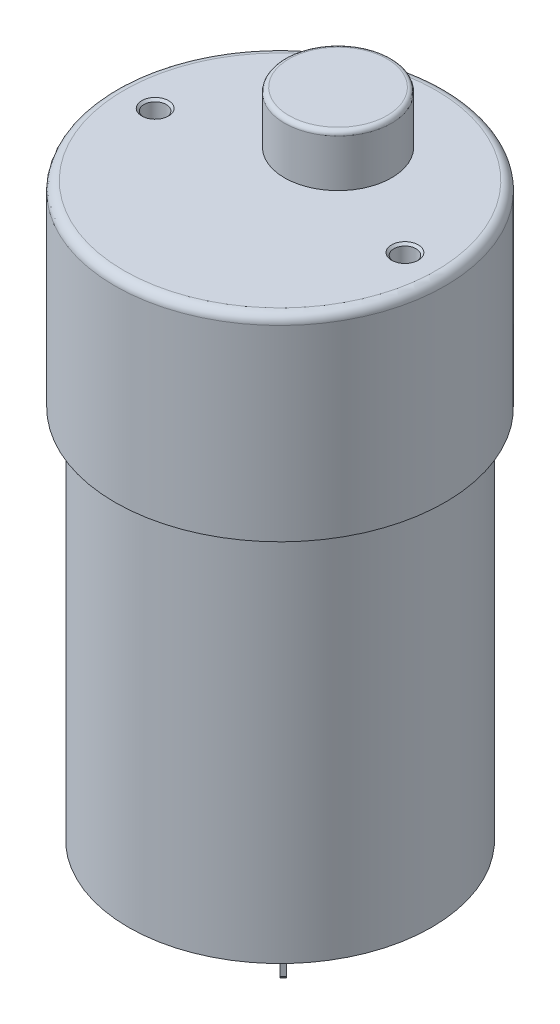
ISO-10303-21;
HEADER;
FILE_DESCRIPTION(('STEP AP214'),'2;1');
FILE_NAME('part.step','',(''),(''),'','','');
FILE_SCHEMA(('AUTOMOTIVE_DESIGN { 1 0 10303 214 1 1 1 1 }'));
ENDSEC;
DATA;
#1=APPLICATION_CONTEXT('core data for automotive mechanical design processes');
#2=APPLICATION_PROTOCOL_DEFINITION('international standard','automotive_design',2000,#1);
#3=PRODUCT_CONTEXT('',#1,'mechanical');
#4=PRODUCT('Part','Part','',(#3));
#5=PRODUCT_RELATED_PRODUCT_CATEGORY('part','',(#4));
#6=PRODUCT_DEFINITION_FORMATION('','',#4);
#7=PRODUCT_DEFINITION_CONTEXT('part definition',#1,'design');
#8=PRODUCT_DEFINITION('design','',#6,#7);
#9=PRODUCT_DEFINITION_SHAPE('','',#8);
#10=(LENGTH_UNIT() NAMED_UNIT(*) SI_UNIT(.MILLI.,.METRE.));
#11=(NAMED_UNIT(*) PLANE_ANGLE_UNIT() SI_UNIT($,.RADIAN.));
#12=(NAMED_UNIT(*) SI_UNIT($,.STERADIAN.) SOLID_ANGLE_UNIT());
#13=UNCERTAINTY_MEASURE_WITH_UNIT(LENGTH_MEASURE(1.E-05),#10,'distance_accuracy_value','');
#14=(GEOMETRIC_REPRESENTATION_CONTEXT(3) GLOBAL_UNCERTAINTY_ASSIGNED_CONTEXT((#13)) GLOBAL_UNIT_ASSIGNED_CONTEXT((#10,
#11,#12)) REPRESENTATION_CONTEXT('',''));
#15=CARTESIAN_POINT('',(0.,0.,0.));
#16=DIRECTION('',(0.,0.,1.));
#17=DIRECTION('',(1.,0.,0.));
#18=AXIS2_PLACEMENT_3D('',#15,#16,#17);
#19=CARTESIAN_POINT('',(0.,-44.5,0.));
#20=DIRECTION('',(0.,-1.,0.));
#21=DIRECTION('',(0.,0.,-1.));
#22=AXIS2_PLACEMENT_3D('',#19,#20,#21);
#23=PLANE('',#22);
#24=CARTESIAN_POINT('',(0.,-44.4999999999709,0.));
#25=DIRECTION('',(0.,1.,0.));
#26=DIRECTION('',(0.,0.,1.));
#27=AXIS2_PLACEMENT_3D('',#24,#25,#26);
#28=CIRCLE('',#27,1.99999999995271);
#29=CARTESIAN_POINT('',(0.,-44.4999999999709,1.99999999995271));
#30=VERTEX_POINT('',#29);
#31=EDGE_CURVE('E39',#30,#30,#28,.T.);
#32=ORIENTED_EDGE('',*,*,#31,.F.);
#33=EDGE_LOOP('',(#32));
#34=FACE_BOUND('',#33,.T.);
#35=ADVANCED_FACE('F36',(#34),#23,.T.);
#36=CARTESIAN_POINT('',(0.,27.8,0.));
#37=DIRECTION('',(0.,1.,0.));
#38=DIRECTION('',(0.,0.,1.));
#39=AXIS2_PLACEMENT_3D('',#36,#37,#38);
#40=PLANE('',#39);
#41=CARTESIAN_POINT('',(0.,27.8,-6.5));
#42=DIRECTION('',(0.,-1.,0.));
#43=DIRECTION('',(1.,0.,0.));
#44=AXIS2_PLACEMENT_3D('',#41,#42,#43);
#45=CIRCLE('',#44,5.5);
#46=CARTESIAN_POINT('',(5.5,27.8,-6.5));
#47=VERTEX_POINT('',#46);
#48=EDGE_CURVE('E240',#47,#47,#45,.T.);
#49=ORIENTED_EDGE('',*,*,#48,.F.);
#50=EDGE_LOOP('',(#49));
#51=FACE_BOUND('',#50,.T.);
#52=ADVANCED_FACE('F440',(#51),#40,.T.);
#53=CARTESIAN_POINT('',(0.,-43.4999999999945,0.));
#54=DIRECTION('',(0.,1.,0.));
#55=DIRECTION('',(0.,0.,1.));
#56=AXIS2_PLACEMENT_3D('',#53,#54,#55);
#57=CONICAL_SURFACE('',#56,2.9999999999859,0.78539816342587);
#58=CARTESIAN_POINT('',(0.,-43.5,0.));
#59=DIRECTION('',(0.,-1.,0.));
#60=DIRECTION('',(0.,0.,-1.));
#61=AXIS2_PLACEMENT_3D('',#58,#59,#60);
#62=CIRCLE('',#61,3.);
#63=CARTESIAN_POINT('',(0.,-43.5,-3.));
#64=VERTEX_POINT('',#63);
#65=EDGE_CURVE('E235',#64,#64,#62,.F.);
#66=ORIENTED_EDGE('',*,*,#65,.F.);
#67=EDGE_LOOP('',(#66));
#68=FACE_BOUND('',#67,.T.);
#69=ORIENTED_EDGE('',*,*,#31,.T.);
#70=EDGE_LOOP('',(#69));
#71=FACE_BOUND('',#70,.T.);
#72=ADVANCED_FACE('F254',(#68,#71),#57,.T.);
#73=CARTESIAN_POINT('',(0.,27.3,-6.5));
#74=DIRECTION('',(0.,1.,0.));
#75=DIRECTION('',(0.,0.,1.));
#76=AXIS2_PLACEMENT_3D('',#73,#74,#75);
#77=TOROIDAL_SURFACE('',#76,5.5,0.5);
#78=CARTESIAN_POINT('',(0.,27.3,-6.5));
#79=DIRECTION('',(0.,1.,0.));
#80=DIRECTION('',(0.,0.,1.));
#81=AXIS2_PLACEMENT_3D('',#78,#79,#80);
#82=CIRCLE('',#81,6.);
#83=CARTESIAN_POINT('',(0.,27.3,-0.5));
#84=VERTEX_POINT('',#83);
#85=EDGE_CURVE('E232',#84,#84,#82,.F.);
#86=ORIENTED_EDGE('',*,*,#85,.F.);
#87=EDGE_LOOP('',(#86));
#88=FACE_BOUND('',#87,.T.);
#89=ORIENTED_EDGE('',*,*,#48,.T.);
#90=EDGE_LOOP('',(#89));
#91=FACE_BOUND('',#90,.T.);
#92=ADVANCED_FACE('F248',(#88,#91),#77,.T.);
#93=CARTESIAN_POINT('',(0.,-41.,0.));
#94=DIRECTION('',(0.,-1.,0.));
#95=DIRECTION('',(0.,0.,-1.));
#96=AXIS2_PLACEMENT_3D('',#93,#94,#95);
#97=CYLINDRICAL_SURFACE('',#96,3.);
#98=CARTESIAN_POINT('',(0.,-42.,0.));
#99=DIRECTION('',(0.,-1.,0.));
#100=DIRECTION('',(0.,0.,-1.));
#101=AXIS2_PLACEMENT_3D('',#98,#99,#100);
#102=CIRCLE('',#101,3.);
#103=CARTESIAN_POINT('',(0.,-42.,-3.));
#104=VERTEX_POINT('',#103);
#105=EDGE_CURVE('E207',#104,#104,#102,.T.);
#106=ORIENTED_EDGE('',*,*,#105,.T.);
#107=EDGE_LOOP('',(#106));
#108=FACE_BOUND('',#107,.T.);
#109=ORIENTED_EDGE('',*,*,#65,.T.);
#110=EDGE_LOOP('',(#109));
#111=FACE_BOUND('',#110,.T.);
#112=ADVANCED_FACE('F253',(#108,#111),#97,.T.);
#113=CARTESIAN_POINT('',(0.,22.,-6.5));
#114=DIRECTION('',(0.,1.,0.));
#115=DIRECTION('',(0.,0.,1.));
#116=AXIS2_PLACEMENT_3D('',#113,#114,#115);
#117=CYLINDRICAL_SURFACE('',#116,6.);
#118=CARTESIAN_POINT('',(0.,22.,-6.5));
#119=DIRECTION('',(0.,1.,0.));
#120=DIRECTION('',(0.,0.,1.));
#121=AXIS2_PLACEMENT_3D('',#118,#119,#120);
#122=CIRCLE('',#121,6.);
#123=CARTESIAN_POINT('',(0.,22.,-0.5));
#124=VERTEX_POINT('',#123);
#125=EDGE_CURVE('E301',#124,#124,#122,.F.);
#126=ORIENTED_EDGE('',*,*,#125,.F.);
#127=EDGE_LOOP('',(#126));
#128=FACE_BOUND('',#127,.T.);
#129=ORIENTED_EDGE('',*,*,#85,.T.);
#130=EDGE_LOOP('',(#129));
#131=FACE_BOUND('',#130,.T.);
#132=ADVANCED_FACE('F425',(#128,#131),#117,.T.);
#133=CARTESIAN_POINT('',(9.41866232540484,-45.75,-9.77221571599806));
#134=DIRECTION('',(0.499999999999998,-0.70710678118655,-0.499999999999998));
#135=DIRECTION('',(0.,0.577350269189623,-0.816496580927728));
#136=AXIS2_PLACEMENT_3D('',#133,#134,#135);
#137=PLANE('',#136);
#138=DIRECTION('',(-0.500000000000015,-0.707106781186526,0.500000000000015));
#139=VECTOR('',#138,1.);
#140=CARTESIAN_POINT('',(9.41866232540483,-45.5,-10.1257691065914));
#141=LINE('',#140,#139);
#142=CARTESIAN_POINT('',(9.41866232540481,-45.5,-10.1257691065914));
#143=VERTEX_POINT('',#142);
#144=CARTESIAN_POINT('',(9.06510893481154,-46.,-9.77221571599808));
#145=VERTEX_POINT('',#144);
#146=EDGE_CURVE('E299',#143,#145,#141,.T.);
#147=ORIENTED_EDGE('',*,*,#146,.F.);
#148=DIRECTION('',(-0.707106781186548,0.,-0.707106781186548));
#149=VECTOR('',#148,1.);
#150=CARTESIAN_POINT('',(9.41866232540481,-45.5,-10.1257691065914));
#151=LINE('',#150,#149);
#152=CARTESIAN_POINT('',(9.77221571599809,-45.5,-9.77221571599809));
#153=VERTEX_POINT('',#152);
#154=EDGE_CURVE('E221',#153,#143,#151,.T.);
#155=ORIENTED_EDGE('',*,*,#154,.F.);
#156=DIRECTION('',(0.500000000000004,0.707106781186542,-0.500000000000004));
#157=VECTOR('',#156,1.);
#158=CARTESIAN_POINT('',(9.41866232540481,-46.,-9.41866232540481));
#159=LINE('',#158,#157);
#160=CARTESIAN_POINT('',(9.41866232540481,-46.,-9.41866232540481));
#161=VERTEX_POINT('',#160);
#162=EDGE_CURVE('E125',#161,#153,#159,.T.);
#163=ORIENTED_EDGE('',*,*,#162,.F.);
#164=DIRECTION('',(0.707106781186548,0.,0.707106781186548));
#165=VECTOR('',#164,1.);
#166=CARTESIAN_POINT('',(9.06510893481154,-46.,-9.77221571599808));
#167=LINE('',#166,#165);
#168=EDGE_CURVE('E230',#145,#161,#167,.T.);
#169=ORIENTED_EDGE('',*,*,#168,.F.);
#170=EDGE_LOOP('',(#147,#155,#163,#169));
#171=FACE_BOUND('',#170,.T.);
#172=ADVANCED_FACE('F422',(#171),#137,.T.);
#173=CARTESIAN_POINT('',(0.,-46.,0.));
#174=DIRECTION('',(0.,-1.,0.));
#175=DIRECTION('',(0.,0.,-1.));
#176=AXIS2_PLACEMENT_3D('',#173,#174,#175);
#177=PLANE('',#176);
#178=DIRECTION('',(0.707106781186547,0.,0.707106781186547));
#179=VECTOR('',#178,1.);
#180=CARTESIAN_POINT('',(8.00444876303172,-46.,-8.71155554421827));
#181=LINE('',#180,#179);
#182=CARTESIAN_POINT('',(8.00444876303172,-46.,-8.71155554421827));
#183=VERTEX_POINT('',#182);
#184=CARTESIAN_POINT('',(8.35800215362499,-46.,-8.358002153625));
#185=VERTEX_POINT('',#184);
#186=EDGE_CURVE('E228',#183,#185,#181,.T.);
#187=ORIENTED_EDGE('',*,*,#186,.F.);
#188=DIRECTION('',(-0.707106781186548,0.,0.707106781186547));
#189=VECTOR('',#188,1.);
#190=CARTESIAN_POINT('',(7.65089537243844,-46.,-8.35800215362499));
#191=LINE('',#190,#189);
#192=EDGE_CURVE('E801',#145,#183,#191,.T.);
#193=ORIENTED_EDGE('',*,*,#192,.F.);
#194=ORIENTED_EDGE('',*,*,#168,.T.);
#195=DIRECTION('',(0.707106781186548,0.,-0.707106781186548));
#196=VECTOR('',#195,1.);
#197=CARTESIAN_POINT('',(9.77221571599809,-46.,-9.77221571599809));
#198=LINE('',#197,#196);
#199=EDGE_CURVE('E300',#185,#161,#198,.T.);
#200=ORIENTED_EDGE('',*,*,#199,.F.);
#201=EDGE_LOOP('',(#187,#193,#194,#200));
#202=FACE_BOUND('',#201,.T.);
#203=ADVANCED_FACE('F418',(#202),#177,.T.);
#204=CARTESIAN_POINT('',(8.00444876303172,-45.75,-8.35800215362499));
#205=DIRECTION('',(-0.499999999999997,-0.70710678118655,0.499999999999999));
#206=DIRECTION('',(0.,-0.577350269189624,-0.816496580927727));
#207=AXIS2_PLACEMENT_3D('',#204,#205,#206);
#208=PLANE('',#207);
#209=DIRECTION('',(0.5,-0.707106781186547,-0.5));
#210=VECTOR('',#209,1.);
#211=CARTESIAN_POINT('',(8.00444876303172,-45.5,-8.00444876303172));
#212=LINE('',#211,#210);
#213=CARTESIAN_POINT('',(8.00444876303172,-45.5,-8.00444876303172));
#214=VERTEX_POINT('',#213);
#215=EDGE_CURVE('E777',#214,#185,#212,.T.);
#216=ORIENTED_EDGE('',*,*,#215,.F.);
#217=DIRECTION('',(0.707106781186548,0.,0.707106781186547));
#218=VECTOR('',#217,1.);
#219=CARTESIAN_POINT('',(8.00444876303172,-45.5,-8.00444876303172));
#220=LINE('',#219,#218);
#221=CARTESIAN_POINT('',(7.65089537243844,-45.5,-8.35800215362499));
#222=VERTEX_POINT('',#221);
#223=EDGE_CURVE('E226',#222,#214,#220,.T.);
#224=ORIENTED_EDGE('',*,*,#223,.F.);
#225=DIRECTION('',(-0.500000000000004,0.707106781186543,0.500000000000002));
#226=VECTOR('',#225,1.);
#227=CARTESIAN_POINT('',(8.00444876303172,-46.,-8.71155554421827));
#228=LINE('',#227,#226);
#229=EDGE_CURVE('E798',#183,#222,#228,.T.);
#230=ORIENTED_EDGE('',*,*,#229,.F.);
#231=ORIENTED_EDGE('',*,*,#186,.T.);
#232=EDGE_LOOP('',(#216,#224,#230,#231));
#233=FACE_BOUND('',#232,.T.);
#234=ADVANCED_FACE('F414',(#233),#208,.T.);
#235=CARTESIAN_POINT('',(8.00444876303172,-41.,-8.00444876303172));
#236=DIRECTION('',(-0.707106781186547,0.,0.707106781186548));
#237=DIRECTION('',(0.707106781186548,0.,0.707106781186547));
#238=AXIS2_PLACEMENT_3D('',#235,#236,#237);
#239=PLANE('',#238);
#240=DIRECTION('',(0.707106781186548,0.,0.707106781186547));
#241=VECTOR('',#240,1.);
#242=CARTESIAN_POINT('',(8.00444876303172,-41.,-8.00444876303172));
#243=LINE('',#242,#241);
#244=CARTESIAN_POINT('',(8.00444876303172,-41.,-8.00444876303172));
#245=VERTEX_POINT('',#244);
#246=CARTESIAN_POINT('',(7.65089537243844,-41.,-8.35800215362499));
#247=VERTEX_POINT('',#246);
#248=EDGE_CURVE('E224',#245,#247,#243,.F.);
#249=ORIENTED_EDGE('',*,*,#248,.T.);
#250=DIRECTION('',(0.,1.,0.));
#251=VECTOR('',#250,1.);
#252=CARTESIAN_POINT('',(7.65089537243844,-41.,-8.35800215362499));
#253=LINE('',#252,#251);
#254=EDGE_CURVE('E795',#222,#247,#253,.T.);
#255=ORIENTED_EDGE('',*,*,#254,.F.);
#256=ORIENTED_EDGE('',*,*,#223,.T.);
#257=DIRECTION('',(0.,1.,0.));
#258=VECTOR('',#257,1.);
#259=CARTESIAN_POINT('',(8.00444876303172,-41.,-8.00444876303172));
#260=LINE('',#259,#258);
#261=EDGE_CURVE('E781',#245,#214,#260,.F.);
#262=ORIENTED_EDGE('',*,*,#261,.F.);
#263=EDGE_LOOP('',(#249,#255,#256,#262));
#264=FACE_BOUND('',#263,.T.);
#265=ADVANCED_FACE('F410',(#264),#239,.T.);
#266=CARTESIAN_POINT('',(9.41866232540481,-41.,-10.1257691065914));
#267=DIRECTION('',(0.707106781186548,0.,-0.707106781186548));
#268=DIRECTION('',(-0.707106781186548,0.,-0.707106781186548));
#269=AXIS2_PLACEMENT_3D('',#266,#267,#268);
#270=PLANE('',#269);
#271=DIRECTION('',(-0.707106781186548,0.,-0.707106781186548));
#272=VECTOR('',#271,1.);
#273=CARTESIAN_POINT('',(9.41866232540481,-41.,-10.1257691065914));
#274=LINE('',#273,#272);
#275=CARTESIAN_POINT('',(9.41866232540482,-41.,-10.1257691065914));
#276=VERTEX_POINT('',#275);
#277=CARTESIAN_POINT('',(9.7722157159981,-41.,-9.7722157159981));
#278=VERTEX_POINT('',#277);
#279=EDGE_CURVE('E219',#276,#278,#274,.F.);
#280=ORIENTED_EDGE('',*,*,#279,.T.);
#281=DIRECTION('',(0.,1.,0.));
#282=VECTOR('',#281,1.);
#283=CARTESIAN_POINT('',(9.77221571599809,-41.,-9.77221571599809));
#284=LINE('',#283,#282);
#285=EDGE_CURVE('E784',#153,#278,#284,.T.);
#286=ORIENTED_EDGE('',*,*,#285,.F.);
#287=ORIENTED_EDGE('',*,*,#154,.T.);
#288=DIRECTION('',(0.,1.,0.));
#289=VECTOR('',#288,1.);
#290=CARTESIAN_POINT('',(9.41866232540483,-41.,-10.1257691065914));
#291=LINE('',#290,#289);
#292=EDGE_CURVE('E295',#276,#143,#291,.F.);
#293=ORIENTED_EDGE('',*,*,#292,.F.);
#294=EDGE_LOOP('',(#280,#286,#287,#293));
#295=FACE_BOUND('',#294,.T.);
#296=ADVANCED_FACE('F406',(#295),#270,.T.);
#297=CARTESIAN_POINT('',(8.53477884892163,-45.,-9.24188563010818));
#298=DIRECTION('',(-0.707106781186547,0.,-0.707106781186548));
#299=DIRECTION('',(-0.707106781186548,0.,0.707106781186547));
#300=AXIS2_PLACEMENT_3D('',#297,#298,#299);
#301=CYLINDRICAL_SURFACE('',#300,0.5);
#302=CARTESIAN_POINT('',(8.53477884892163,-45.,-9.24188563010818));
#303=DIRECTION('',(-0.707106781186547,0.,-0.707106781186548));
#304=DIRECTION('',(-0.707106781186548,0.,0.707106781186547));
#305=AXIS2_PLACEMENT_3D('',#302,#303,#304);
#306=CIRCLE('',#305,0.5);
#307=CARTESIAN_POINT('',(8.18122545832836,-45.,-8.88833223951491));
#308=VERTEX_POINT('',#307);
#309=EDGE_CURVE('E291',#308,#308,#306,.F.);
#310=ORIENTED_EDGE('',*,*,#309,.F.);
#311=EDGE_LOOP('',(#310));
#312=FACE_BOUND('',#311,.T.);
#313=CARTESIAN_POINT('',(8.88833223951491,-45.,-8.88833223951491));
#314=DIRECTION('',(-0.707106781186547,0.,-0.707106781186548));
#315=DIRECTION('',(-0.707106781186548,0.,0.707106781186547));
#316=AXIS2_PLACEMENT_3D('',#313,#314,#315);
#317=CIRCLE('',#316,0.5);
#318=CARTESIAN_POINT('',(8.53477884892163,-45.,-8.53477884892163));
#319=VERTEX_POINT('',#318);
#320=EDGE_CURVE('E296',#319,#319,#317,.T.);
#321=ORIENTED_EDGE('',*,*,#320,.F.);
#322=EDGE_LOOP('',(#321));
#323=FACE_BOUND('',#322,.T.);
#324=ADVANCED_FACE('F402',(#312,#323),#301,.F.);
#325=CARTESIAN_POINT('',(8.358002153625,-45.75,8.00444876303171));
#326=DIRECTION('',(-0.5,-0.707106781186547,-0.5));
#327=DIRECTION('',(0.,0.577350269189626,-0.816496580927726));
#328=AXIS2_PLACEMENT_3D('',#325,#326,#327);
#329=PLANE('',#328);
#330=DIRECTION('',(0.499999999999998,-0.707106781186552,0.499999999999996));
#331=VECTOR('',#330,1.);
#332=CARTESIAN_POINT('',(8.00444876303172,-45.5,8.00444876303172));
#333=LINE('',#332,#331);
#334=CARTESIAN_POINT('',(8.00444876303172,-45.5,8.00444876303172));
#335=VERTEX_POINT('',#334);
#336=CARTESIAN_POINT('',(8.35800215362499,-46.,8.35800215362499));
#337=VERTEX_POINT('',#336);
#338=EDGE_CURVE('E294',#335,#337,#333,.T.);
#339=ORIENTED_EDGE('',*,*,#338,.F.);
#340=DIRECTION('',(-0.707106781186547,0.,0.707106781186548));
#341=VECTOR('',#340,1.);
#342=CARTESIAN_POINT('',(8.00444876303172,-45.5,8.00444876303172));
#343=LINE('',#342,#341);
#344=CARTESIAN_POINT('',(8.35800215362499,-45.5,7.65089537243844));
#345=VERTEX_POINT('',#344);
#346=EDGE_CURVE('E216',#345,#335,#343,.T.);
#347=ORIENTED_EDGE('',*,*,#346,.F.);
#348=DIRECTION('',(-0.500000000000004,0.707106781186543,-0.500000000000002));
#349=VECTOR('',#348,1.);
#350=CARTESIAN_POINT('',(8.71155554421827,-46.,8.00444876303172));
#351=LINE('',#350,#349);
#352=CARTESIAN_POINT('',(8.71155554421827,-46.,8.00444876303172));
#353=VERTEX_POINT('',#352);
#354=EDGE_CURVE('E289',#353,#345,#351,.T.);
#355=ORIENTED_EDGE('',*,*,#354,.F.);
#356=DIRECTION('',(0.707106781186554,0.,-0.707106781186541));
#357=VECTOR('',#356,1.);
#358=CARTESIAN_POINT('',(8.35800215362499,-46.,8.35800215362499));
#359=LINE('',#358,#357);
#360=EDGE_CURVE('E208',#337,#353,#359,.T.);
#361=ORIENTED_EDGE('',*,*,#360,.F.);
#362=EDGE_LOOP('',(#339,#347,#355,#361));
#363=FACE_BOUND('',#362,.T.);
#364=ADVANCED_FACE('F399',(#363),#329,.T.);
#365=CARTESIAN_POINT('',(8.00444876303172,-41.,8.00444876303172));
#366=DIRECTION('',(-0.707106781186548,0.,-0.707106781186547));
#367=DIRECTION('',(-0.707106781186547,0.,0.707106781186548));
#368=AXIS2_PLACEMENT_3D('',#365,#366,#367);
#369=PLANE('',#368);
#370=DIRECTION('',(-0.707106781186547,0.,0.707106781186548));
#371=VECTOR('',#370,1.);
#372=CARTESIAN_POINT('',(8.00444876303172,-41.,8.00444876303172));
#373=LINE('',#372,#371);
#374=CARTESIAN_POINT('',(8.00444876303172,-41.,8.00444876303172));
#375=VERTEX_POINT('',#374);
#376=CARTESIAN_POINT('',(8.35800215362499,-41.,7.65089537243845));
#377=VERTEX_POINT('',#376);
#378=EDGE_CURVE('E54',#375,#377,#373,.F.);
#379=ORIENTED_EDGE('',*,*,#378,.T.);
#380=DIRECTION('',(0.,1.,0.));
#381=VECTOR('',#380,1.);
#382=CARTESIAN_POINT('',(8.35800215362499,-41.,7.65089537243844));
#383=LINE('',#382,#381);
#384=EDGE_CURVE('E825',#345,#377,#383,.T.);
#385=ORIENTED_EDGE('',*,*,#384,.F.);
#386=ORIENTED_EDGE('',*,*,#346,.T.);
#387=DIRECTION('',(0.,1.,0.));
#388=VECTOR('',#387,1.);
#389=CARTESIAN_POINT('',(8.00444876303172,-41.,8.00444876303172));
#390=LINE('',#389,#388);
#391=EDGE_CURVE('E290',#375,#335,#390,.F.);
#392=ORIENTED_EDGE('',*,*,#391,.F.);
#393=EDGE_LOOP('',(#379,#385,#386,#392));
#394=FACE_BOUND('',#393,.T.);
#395=ADVANCED_FACE('F395',(#394),#369,.T.);
#396=CARTESIAN_POINT('',(10.1257691065914,-41.,9.41866232540482));
#397=DIRECTION('',(0.707106781186548,0.,0.707106781186547));
#398=DIRECTION('',(0.707106781186547,0.,-0.707106781186548));
#399=AXIS2_PLACEMENT_3D('',#396,#397,#398);
#400=PLANE('',#399);
#401=DIRECTION('',(0.707106781186547,0.,-0.707106781186548));
#402=VECTOR('',#401,1.);
#403=CARTESIAN_POINT('',(10.1257691065914,-41.,9.41866232540482));
#404=LINE('',#403,#402);
#405=CARTESIAN_POINT('',(10.1257691065914,-41.,9.41866232540482));
#406=VERTEX_POINT('',#405);
#407=CARTESIAN_POINT('',(9.7722157159981,-41.,9.7722157159981));
#408=VERTEX_POINT('',#407);
#409=EDGE_CURVE('E213',#406,#408,#404,.F.);
#410=ORIENTED_EDGE('',*,*,#409,.T.);
#411=DIRECTION('',(0.,1.,0.));
#412=VECTOR('',#411,1.);
#413=CARTESIAN_POINT('',(9.77221571599809,-41.,9.77221571599809));
#414=LINE('',#413,#412);
#415=CARTESIAN_POINT('',(9.7722157159981,-45.5,9.7722157159981));
#416=VERTEX_POINT('',#415);
#417=EDGE_CURVE('E818',#416,#408,#414,.T.);
#418=ORIENTED_EDGE('',*,*,#417,.F.);
#419=DIRECTION('',(-0.70710678118657,0.,0.707106781186525));
#420=VECTOR('',#419,1.);
#421=CARTESIAN_POINT('',(10.1257691065914,-45.5,9.41866232540481));
#422=LINE('',#421,#420);
#423=CARTESIAN_POINT('',(10.1257691065914,-45.5,9.41866232540482));
#424=VERTEX_POINT('',#423);
#425=EDGE_CURVE('E211',#424,#416,#422,.T.);
#426=ORIENTED_EDGE('',*,*,#425,.F.);
#427=DIRECTION('',(0.,1.,0.));
#428=VECTOR('',#427,1.);
#429=CARTESIAN_POINT('',(10.1257691065914,-41.,9.41866232540483));
#430=LINE('',#429,#428);
#431=EDGE_CURVE('E827',#406,#424,#430,.F.);
#432=ORIENTED_EDGE('',*,*,#431,.F.);
#433=EDGE_LOOP('',(#410,#418,#426,#432));
#434=FACE_BOUND('',#433,.T.);
#435=ADVANCED_FACE('F391',(#434),#400,.T.);
#436=CARTESIAN_POINT('',(9.7722157159981,-45.75,9.41866232540481));
#437=DIRECTION('',(0.499999999999993,-0.707106781186558,0.499999999999993));
#438=DIRECTION('',(0.,-0.577350269189615,-0.816496580927734));
#439=AXIS2_PLACEMENT_3D('',#436,#437,#438);
#440=PLANE('',#439);
#441=DIRECTION('',(-0.500000000000022,-0.707106781186516,-0.500000000000022));
#442=VECTOR('',#441,1.);
#443=CARTESIAN_POINT('',(10.1257691065914,-45.5,9.41866232540483));
#444=LINE('',#443,#442);
#445=CARTESIAN_POINT('',(9.77221571599808,-46.,9.06510893481153));
#446=VERTEX_POINT('',#445);
#447=EDGE_CURVE('E829',#424,#446,#444,.T.);
#448=ORIENTED_EDGE('',*,*,#447,.F.);
#449=ORIENTED_EDGE('',*,*,#425,.T.);
#450=DIRECTION('',(0.499999999999996,0.707106781186552,0.499999999999996));
#451=VECTOR('',#450,1.);
#452=CARTESIAN_POINT('',(9.41866232540482,-46.,9.41866232540482));
#453=LINE('',#452,#451);
#454=CARTESIAN_POINT('',(9.41866232540482,-46.,9.41866232540482));
#455=VERTEX_POINT('',#454);
#456=EDGE_CURVE('E815',#455,#416,#453,.T.);
#457=ORIENTED_EDGE('',*,*,#456,.F.);
#458=DIRECTION('',(-0.707106781186516,0.,0.707106781186579));
#459=VECTOR('',#458,1.);
#460=CARTESIAN_POINT('',(9.77221571599808,-46.,9.06510893481153));
#461=LINE('',#460,#459);
#462=EDGE_CURVE('E200',#446,#455,#461,.T.);
#463=ORIENTED_EDGE('',*,*,#462,.F.);
#464=EDGE_LOOP('',(#448,#449,#457,#463));
#465=FACE_BOUND('',#464,.T.);
#466=ADVANCED_FACE('F387',(#465),#440,.T.);
#467=CARTESIAN_POINT('',(0.,-46.,0.));
#468=DIRECTION('',(0.,-1.,0.));
#469=DIRECTION('',(0.,0.,-1.));
#470=AXIS2_PLACEMENT_3D('',#467,#468,#469);
#471=PLANE('',#470);
#472=ORIENTED_EDGE('',*,*,#462,.T.);
#473=DIRECTION('',(0.707106781186548,0.,0.707106781186547));
#474=VECTOR('',#473,1.);
#475=CARTESIAN_POINT('',(9.77221571599809,-46.,9.77221571599809));
#476=LINE('',#475,#474);
#477=EDGE_CURVE('E812',#337,#455,#476,.T.);
#478=ORIENTED_EDGE('',*,*,#477,.F.);
#479=ORIENTED_EDGE('',*,*,#360,.T.);
#480=DIRECTION('',(-0.707106781186548,0.,-0.707106781186547));
#481=VECTOR('',#480,1.);
#482=CARTESIAN_POINT('',(8.35800215362499,-46.,7.65089537243844));
#483=LINE('',#482,#481);
#484=EDGE_CURVE('E180',#446,#353,#483,.T.);
#485=ORIENTED_EDGE('',*,*,#484,.F.);
#486=EDGE_LOOP('',(#472,#478,#479,#485));
#487=FACE_BOUND('',#486,.T.);
#488=ADVANCED_FACE('F383',(#487),#471,.T.);
#489=CARTESIAN_POINT('',(8.88833223951491,-45.,8.8883322395149));
#490=DIRECTION('',(-0.707106781186547,0.,0.707106781186548));
#491=DIRECTION('',(0.707106781186548,0.,0.707106781186547));
#492=AXIS2_PLACEMENT_3D('',#489,#490,#491);
#493=CYLINDRICAL_SURFACE('',#492,0.5);
#494=CARTESIAN_POINT('',(9.24188563010818,-45.,8.53477884892164));
#495=DIRECTION('',(-0.707106781186547,0.,0.707106781186548));
#496=DIRECTION('',(0.707106781186548,0.,0.707106781186547));
#497=AXIS2_PLACEMENT_3D('',#494,#495,#496);
#498=CIRCLE('',#497,0.5);
#499=CARTESIAN_POINT('',(9.59543902070145,-45.,8.88833223951491));
#500=VERTEX_POINT('',#499);
#501=EDGE_CURVE('E283',#500,#500,#498,.T.);
#502=ORIENTED_EDGE('',*,*,#501,.F.);
#503=EDGE_LOOP('',(#502));
#504=FACE_BOUND('',#503,.T.);
#505=CARTESIAN_POINT('',(8.88833223951491,-45.,8.88833223951491));
#506=DIRECTION('',(-0.707106781186547,0.,0.707106781186548));
#507=DIRECTION('',(0.707106781186548,0.,0.707106781186547));
#508=AXIS2_PLACEMENT_3D('',#505,#506,#507);
#509=CIRCLE('',#508,0.5);
#510=CARTESIAN_POINT('',(9.24188563010818,-45.,9.24188563010818));
#511=VERTEX_POINT('',#510);
#512=EDGE_CURVE('E286',#511,#511,#509,.F.);
#513=ORIENTED_EDGE('',*,*,#512,.F.);
#514=EDGE_LOOP('',(#513));
#515=FACE_BOUND('',#514,.T.);
#516=ADVANCED_FACE('F312',(#504,#515),#493,.F.);
#517=CARTESIAN_POINT('',(0.,-42.,0.));
#518=DIRECTION('',(0.,1.,0.));
#519=DIRECTION('',(0.,0.,1.));
#520=AXIS2_PLACEMENT_3D('',#517,#518,#519);
#521=PLANE('',#520);
#522=ORIENTED_EDGE('',*,*,#105,.F.);
#523=EDGE_LOOP('',(#522));
#524=FACE_BOUND('',#523,.T.);
#525=CARTESIAN_POINT('',(0.,-42.,0.));
#526=DIRECTION('',(0.,-1.,0.));
#527=DIRECTION('',(0.,0.,-1.));
#528=AXIS2_PLACEMENT_3D('',#525,#526,#527);
#529=CIRCLE('',#528,5.);
#530=CARTESIAN_POINT('',(0.,-42.,-5.));
#531=VERTEX_POINT('',#530);
#532=EDGE_CURVE('E280',#531,#531,#529,.F.);
#533=ORIENTED_EDGE('',*,*,#532,.F.);
#534=EDGE_LOOP('',(#533));
#535=FACE_BOUND('',#534,.T.);
#536=ADVANCED_FACE('F308',(#524,#535),#521,.F.);
#537=CARTESIAN_POINT('',(0.,22.,0.));
#538=DIRECTION('',(0.,1.,0.));
#539=DIRECTION('',(0.,0.,1.));
#540=AXIS2_PLACEMENT_3D('',#537,#538,#539);
#541=PLANE('',#540);
#542=CARTESIAN_POINT('',(-14.,22.,0.));
#543=DIRECTION('',(0.,1.,0.));
#544=DIRECTION('',(0.,0.,1.));
#545=AXIS2_PLACEMENT_3D('',#542,#543,#544);
#546=CIRCLE('',#545,1.5);
#547=CARTESIAN_POINT('',(-14.,22.,1.5));
#548=VERTEX_POINT('',#547);
#549=EDGE_CURVE('E149',#548,#548,#546,.T.);
#550=ORIENTED_EDGE('',*,*,#549,.F.);
#551=EDGE_LOOP('',(#550));
#552=FACE_BOUND('',#551,.T.);
#553=CARTESIAN_POINT('',(14.,22.,0.));
#554=DIRECTION('',(0.,1.,0.));
#555=DIRECTION('',(0.,0.,1.));
#556=AXIS2_PLACEMENT_3D('',#553,#554,#555);
#557=CIRCLE('',#556,1.5);
#558=CARTESIAN_POINT('',(14.,22.,1.5));
#559=VERTEX_POINT('',#558);
#560=EDGE_CURVE('E142',#559,#559,#557,.T.);
#561=ORIENTED_EDGE('',*,*,#560,.F.);
#562=EDGE_LOOP('',(#561));
#563=FACE_BOUND('',#562,.T.);
#564=ORIENTED_EDGE('',*,*,#125,.T.);
#565=EDGE_LOOP('',(#564));
#566=FACE_BOUND('',#565,.T.);
#567=CARTESIAN_POINT('',(0.,22.,0.));
#568=DIRECTION('',(0.,-1.,0.));
#569=DIRECTION('',(0.,0.,-1.));
#570=AXIS2_PLACEMENT_3D('',#567,#568,#569);
#571=CIRCLE('',#570,17.5);
#572=CARTESIAN_POINT('',(0.,22.,-17.5));
#573=VERTEX_POINT('',#572);
#574=EDGE_CURVE('E177',#573,#573,#571,.T.);
#575=ORIENTED_EDGE('',*,*,#574,.F.);
#576=EDGE_LOOP('',(#575));
#577=FACE_BOUND('',#576,.T.);
#578=ADVANCED_FACE('F311',(#552,#563,#566,#577),#541,.T.);
#579=CARTESIAN_POINT('',(9.77221571599809,-41.,-9.77221571599809));
#580=DIRECTION('',(0.707106781186548,0.,0.707106781186548));
#581=DIRECTION('',(0.707106781186548,0.,-0.707106781186548));
#582=AXIS2_PLACEMENT_3D('',#579,#580,#581);
#583=PLANE('',#582);
#584=ORIENTED_EDGE('',*,*,#320,.T.);
#585=EDGE_LOOP('',(#584));
#586=FACE_BOUND('',#585,.T.);
#587=ORIENTED_EDGE('',*,*,#215,.T.);
#588=ORIENTED_EDGE('',*,*,#199,.T.);
#589=ORIENTED_EDGE('',*,*,#162,.T.);
#590=ORIENTED_EDGE('',*,*,#285,.T.);
#591=DIRECTION('',(0.707106781186547,0.,-0.707106781186547));
#592=VECTOR('',#591,1.);
#593=CARTESIAN_POINT('',(8.00444876303172,-41.,-8.00444876303172));
#594=LINE('',#593,#592);
#595=EDGE_CURVE('E174',#245,#278,#594,.T.);
#596=ORIENTED_EDGE('',*,*,#595,.F.);
#597=ORIENTED_EDGE('',*,*,#261,.T.);
#598=EDGE_LOOP('',(#587,#588,#589,#590,#596,#597));
#599=FACE_BOUND('',#598,.T.);
#600=ADVANCED_FACE('F377',(#586,#599),#583,.T.);
#601=CARTESIAN_POINT('',(7.65089537243844,-41.,-8.35800215362499));
#602=DIRECTION('',(-0.707106781186547,0.,-0.707106781186548));
#603=DIRECTION('',(-0.707106781186548,0.,0.707106781186547));
#604=AXIS2_PLACEMENT_3D('',#601,#602,#603);
#605=PLANE('',#604);
#606=ORIENTED_EDGE('',*,*,#309,.T.);
#607=EDGE_LOOP('',(#606));
#608=FACE_BOUND('',#607,.T.);
#609=DIRECTION('',(-0.70710678118654,0.,0.707106781186556));
#610=VECTOR('',#609,1.);
#611=CARTESIAN_POINT('',(9.41866232540481,-41.,-10.1257691065914));
#612=LINE('',#611,#610);
#613=EDGE_CURVE('E171',#276,#247,#612,.T.);
#614=ORIENTED_EDGE('',*,*,#613,.F.);
#615=ORIENTED_EDGE('',*,*,#292,.T.);
#616=ORIENTED_EDGE('',*,*,#146,.T.);
#617=ORIENTED_EDGE('',*,*,#192,.T.);
#618=ORIENTED_EDGE('',*,*,#229,.T.);
#619=ORIENTED_EDGE('',*,*,#254,.T.);
#620=EDGE_LOOP('',(#614,#615,#616,#617,#618,#619));
#621=FACE_BOUND('',#620,.T.);
#622=ADVANCED_FACE('F521',(#608,#621),#605,.T.);
#623=CARTESIAN_POINT('',(9.77221571599809,-41.,9.77221571599809));
#624=DIRECTION('',(-0.707106781186547,0.,0.707106781186548));
#625=DIRECTION('',(0.707106781186548,0.,0.707106781186547));
#626=AXIS2_PLACEMENT_3D('',#623,#624,#625);
#627=PLANE('',#626);
#628=ORIENTED_EDGE('',*,*,#512,.T.);
#629=EDGE_LOOP('',(#628));
#630=FACE_BOUND('',#629,.T.);
#631=DIRECTION('',(0.707106781186547,0.,0.707106781186547));
#632=VECTOR('',#631,1.);
#633=CARTESIAN_POINT('',(8.00444876303172,-41.,8.00444876303172));
#634=LINE('',#633,#632);
#635=EDGE_CURVE('E168',#375,#408,#634,.T.);
#636=ORIENTED_EDGE('',*,*,#635,.F.);
#637=ORIENTED_EDGE('',*,*,#391,.T.);
#638=ORIENTED_EDGE('',*,*,#338,.T.);
#639=ORIENTED_EDGE('',*,*,#477,.T.);
#640=ORIENTED_EDGE('',*,*,#456,.T.);
#641=ORIENTED_EDGE('',*,*,#417,.T.);
#642=EDGE_LOOP('',(#636,#637,#638,#639,#640,#641));
#643=FACE_BOUND('',#642,.T.);
#644=ADVANCED_FACE('F322',(#630,#643),#627,.T.);
#645=CARTESIAN_POINT('',(8.35800215362499,-41.,7.65089537243844));
#646=DIRECTION('',(0.707106781186547,0.,-0.707106781186548));
#647=DIRECTION('',(-0.707106781186548,0.,-0.707106781186547));
#648=AXIS2_PLACEMENT_3D('',#645,#646,#647);
#649=PLANE('',#648);
#650=ORIENTED_EDGE('',*,*,#501,.T.);
#651=EDGE_LOOP('',(#650));
#652=FACE_BOUND('',#651,.T.);
#653=ORIENTED_EDGE('',*,*,#447,.T.);
#654=ORIENTED_EDGE('',*,*,#484,.T.);
#655=ORIENTED_EDGE('',*,*,#354,.T.);
#656=ORIENTED_EDGE('',*,*,#384,.T.);
#657=DIRECTION('',(-0.707106781186555,0.,-0.70710678118654));
#658=VECTOR('',#657,1.);
#659=CARTESIAN_POINT('',(10.1257691065914,-41.,9.41866232540482));
#660=LINE('',#659,#658);
#661=EDGE_CURVE('E165',#406,#377,#660,.T.);
#662=ORIENTED_EDGE('',*,*,#661,.F.);
#663=ORIENTED_EDGE('',*,*,#431,.T.);
#664=EDGE_LOOP('',(#653,#654,#655,#656,#662,#663));
#665=FACE_BOUND('',#664,.T.);
#666=ADVANCED_FACE('F317',(#652,#665),#649,.T.);
#667=CARTESIAN_POINT('',(0.,-42.,0.));
#668=DIRECTION('',(0.,-1.,0.));
#669=DIRECTION('',(0.,0.,-1.));
#670=AXIS2_PLACEMENT_3D('',#667,#668,#669);
#671=CYLINDRICAL_SURFACE('',#670,5.);
#672=CARTESIAN_POINT('',(0.,-41.,0.));
#673=DIRECTION('',(0.,-1.,0.));
#674=DIRECTION('',(0.,0.,-1.));
#675=AXIS2_PLACEMENT_3D('',#672,#673,#674);
#676=CIRCLE('',#675,5.);
#677=CARTESIAN_POINT('',(0.,-41.,-5.));
#678=VERTEX_POINT('',#677);
#679=EDGE_CURVE('E162',#678,#678,#676,.F.);
#680=ORIENTED_EDGE('',*,*,#679,.F.);
#681=EDGE_LOOP('',(#680));
#682=FACE_BOUND('',#681,.T.);
#683=ORIENTED_EDGE('',*,*,#532,.T.);
#684=EDGE_LOOP('',(#683));
#685=FACE_BOUND('',#684,.T.);
#686=ADVANCED_FACE('F189',(#682,#685),#671,.T.);
#687=CARTESIAN_POINT('',(0.,21.,0.));
#688=DIRECTION('',(0.,1.,0.));
#689=DIRECTION('',(0.,0.,1.));
#690=AXIS2_PLACEMENT_3D('',#687,#688,#689);
#691=TOROIDAL_SURFACE('',#690,17.5,1.);
#692=CARTESIAN_POINT('',(0.,21.,0.));
#693=DIRECTION('',(0.,1.,0.));
#694=DIRECTION('',(0.,0.,1.));
#695=AXIS2_PLACEMENT_3D('',#692,#693,#694);
#696=CIRCLE('',#695,18.5);
#697=CARTESIAN_POINT('',(0.,21.,18.5));
#698=VERTEX_POINT('',#697);
#699=EDGE_CURVE('E158',#698,#698,#696,.F.);
#700=ORIENTED_EDGE('',*,*,#699,.F.);
#701=EDGE_LOOP('',(#700));
#702=FACE_BOUND('',#701,.T.);
#703=ORIENTED_EDGE('',*,*,#574,.T.);
#704=EDGE_LOOP('',(#703));
#705=FACE_BOUND('',#704,.T.);
#706=ADVANCED_FACE('F183',(#702,#705),#691,.T.);
#707=CARTESIAN_POINT('',(0.,-41.,0.));
#708=DIRECTION('',(0.,-1.,0.));
#709=DIRECTION('',(0.,0.,-1.));
#710=AXIS2_PLACEMENT_3D('',#707,#708,#709);
#711=PLANE('',#710);
#712=ORIENTED_EDGE('',*,*,#679,.T.);
#713=EDGE_LOOP('',(#712));
#714=FACE_BOUND('',#713,.T.);
#715=ORIENTED_EDGE('',*,*,#661,.T.);
#716=ORIENTED_EDGE('',*,*,#378,.F.);
#717=ORIENTED_EDGE('',*,*,#635,.T.);
#718=ORIENTED_EDGE('',*,*,#409,.F.);
#719=EDGE_LOOP('',(#715,#716,#717,#718));
#720=FACE_BOUND('',#719,.T.);
#721=ORIENTED_EDGE('',*,*,#613,.T.);
#722=ORIENTED_EDGE('',*,*,#248,.F.);
#723=ORIENTED_EDGE('',*,*,#595,.T.);
#724=ORIENTED_EDGE('',*,*,#279,.F.);
#725=EDGE_LOOP('',(#721,#722,#723,#724));
#726=FACE_BOUND('',#725,.T.);
#727=CARTESIAN_POINT('',(0.,-41.,0.));
#728=DIRECTION('',(0.,-1.,0.));
#729=DIRECTION('',(0.,0.,-1.));
#730=AXIS2_PLACEMENT_3D('',#727,#728,#729);
#731=CIRCLE('',#730,16.5);
#732=CARTESIAN_POINT('',(0.,-41.,-16.5));
#733=VERTEX_POINT('',#732);
#734=EDGE_CURVE('E161',#733,#733,#731,.T.);
#735=ORIENTED_EDGE('',*,*,#734,.T.);
#736=EDGE_LOOP('',(#735));
#737=FACE_BOUND('',#736,.T.);
#738=ADVANCED_FACE('F188',(#714,#720,#726,#737),#711,.T.);
#739=CARTESIAN_POINT('',(0.,0.,0.));
#740=DIRECTION('',(0.,1.,0.));
#741=DIRECTION('',(0.,0.,1.));
#742=AXIS2_PLACEMENT_3D('',#739,#740,#741);
#743=CYLINDRICAL_SURFACE('',#742,18.5);
#744=CARTESIAN_POINT('',(0.,0.,0.));
#745=DIRECTION('',(0.,1.,0.));
#746=DIRECTION('',(0.,0.,1.));
#747=AXIS2_PLACEMENT_3D('',#744,#745,#746);
#748=CIRCLE('',#747,18.5);
#749=CARTESIAN_POINT('',(0.,0.,18.5));
#750=VERTEX_POINT('',#749);
#751=EDGE_CURVE('E273',#750,#750,#748,.T.);
#752=ORIENTED_EDGE('',*,*,#751,.T.);
#753=EDGE_LOOP('',(#752));
#754=FACE_BOUND('',#753,.T.);
#755=ORIENTED_EDGE('',*,*,#699,.T.);
#756=EDGE_LOOP('',(#755));
#757=FACE_BOUND('',#756,.T.);
#758=ADVANCED_FACE('F349',(#754,#757),#743,.T.);
#759=CARTESIAN_POINT('',(0.,-42.,0.));
#760=DIRECTION('',(0.,-1.,0.));
#761=DIRECTION('',(0.,0.,-1.));
#762=AXIS2_PLACEMENT_3D('',#759,#760,#761);
#763=CYLINDRICAL_SURFACE('',#762,16.5);
#764=ORIENTED_EDGE('',*,*,#734,.F.);
#765=EDGE_LOOP('',(#764));
#766=FACE_BOUND('',#765,.T.);
#767=CARTESIAN_POINT('',(0.,-42.,0.));
#768=DIRECTION('',(0.,-1.,0.));
#769=DIRECTION('',(0.,0.,-1.));
#770=AXIS2_PLACEMENT_3D('',#767,#768,#769);
#771=CIRCLE('',#770,16.5);
#772=CARTESIAN_POINT('',(0.,-42.,-16.5));
#773=VERTEX_POINT('',#772);
#774=EDGE_CURVE('E270',#773,#773,#771,.T.);
#775=ORIENTED_EDGE('',*,*,#774,.T.);
#776=EDGE_LOOP('',(#775));
#777=FACE_BOUND('',#776,.T.);
#778=ADVANCED_FACE('F346',(#766,#777),#763,.F.);
#779=CARTESIAN_POINT('',(0.,0.,0.));
#780=DIRECTION('',(0.,1.,0.));
#781=DIRECTION('',(0.,0.,1.));
#782=AXIS2_PLACEMENT_3D('',#779,#780,#781);
#783=PLANE('',#782);
#784=CARTESIAN_POINT('',(0.,0.,0.));
#785=DIRECTION('',(0.,1.,0.));
#786=DIRECTION('',(0.,0.,1.));
#787=AXIS2_PLACEMENT_3D('',#784,#785,#786);
#788=CIRCLE('',#787,17.);
#789=CARTESIAN_POINT('',(0.,0.,17.));
#790=VERTEX_POINT('',#789);
#791=EDGE_CURVE('E45',#790,#790,#788,.F.);
#792=ORIENTED_EDGE('',*,*,#791,.F.);
#793=EDGE_LOOP('',(#792));
#794=FACE_BOUND('',#793,.T.);
#795=ORIENTED_EDGE('',*,*,#751,.F.);
#796=EDGE_LOOP('',(#795));
#797=FACE_BOUND('',#796,.T.);
#798=ADVANCED_FACE('F338',(#794,#797),#783,.F.);
#799=CARTESIAN_POINT('',(0.,-42.,0.));
#800=DIRECTION('',(0.,1.,0.));
#801=DIRECTION('',(0.,0.,1.));
#802=AXIS2_PLACEMENT_3D('',#799,#800,#801);
#803=PLANE('',#802);
#804=ORIENTED_EDGE('',*,*,#774,.F.);
#805=EDGE_LOOP('',(#804));
#806=FACE_BOUND('',#805,.T.);
#807=CARTESIAN_POINT('',(0.,-42.,0.));
#808=DIRECTION('',(0.,1.,0.));
#809=DIRECTION('',(0.,0.,1.));
#810=AXIS2_PLACEMENT_3D('',#807,#808,#809);
#811=CIRCLE('',#810,17.);
#812=CARTESIAN_POINT('',(0.,-42.,17.));
#813=VERTEX_POINT('',#812);
#814=EDGE_CURVE('E11',#813,#813,#811,.T.);
#815=ORIENTED_EDGE('',*,*,#814,.F.);
#816=EDGE_LOOP('',(#815));
#817=FACE_BOUND('',#816,.T.);
#818=ADVANCED_FACE('F328',(#806,#817),#803,.F.);
#819=CARTESIAN_POINT('',(0.,0.,0.));
#820=DIRECTION('',(0.,1.,0.));
#821=DIRECTION('',(0.,0.,1.));
#822=AXIS2_PLACEMENT_3D('',#819,#820,#821);
#823=CYLINDRICAL_SURFACE('',#822,17.);
#824=ORIENTED_EDGE('',*,*,#814,.T.);
#825=EDGE_LOOP('',(#824));
#826=FACE_BOUND('',#825,.T.);
#827=ORIENTED_EDGE('',*,*,#791,.T.);
#828=EDGE_LOOP('',(#827));
#829=FACE_BOUND('',#828,.T.);
#830=ADVANCED_FACE('F325',(#826,#829),#823,.T.);
#831=CARTESIAN_POINT('',(14.,13.5164,0.));
#832=DIRECTION('',(0.,1.,0.));
#833=DIRECTION('',(0.,0.,1.));
#834=AXIS2_PLACEMENT_3D('',#831,#832,#833);
#835=CONICAL_SURFACE('',#834,1.24999999999999,1.02974425867665);
#836=CARTESIAN_POINT('',(14.,12.7653242262156,0.));
#837=VERTEX_POINT('',#836);
#838=VERTEX_LOOP('',#837);
#839=FACE_BOUND('',#838,.T.);
#840=CARTESIAN_POINT('',(14.,13.5164,0.));
#841=DIRECTION('',(0.,1.,0.));
#842=DIRECTION('',(0.,0.,1.));
#843=AXIS2_PLACEMENT_3D('',#840,#841,#842);
#844=CIRCLE('',#843,1.24999999999999);
#845=CARTESIAN_POINT('',(14.,13.5164,1.24999999999999));
#846=VERTEX_POINT('',#845);
#847=EDGE_CURVE('E155',#846,#846,#844,.T.);
#848=ORIENTED_EDGE('',*,*,#847,.T.);
#849=EDGE_LOOP('',(#848));
#850=FACE_BOUND('',#849,.T.);
#851=ADVANCED_FACE('F327',(#839,#850),#835,.F.);
#852=CARTESIAN_POINT('',(14.,22.,0.));
#853=DIRECTION('',(0.,1.,0.));
#854=DIRECTION('',(0.,0.,1.));
#855=AXIS2_PLACEMENT_3D('',#852,#853,#854);
#856=CYLINDRICAL_SURFACE('',#855,1.24999999999999);
#857=ORIENTED_EDGE('',*,*,#847,.F.);
#858=EDGE_LOOP('',(#857));
#859=FACE_BOUND('',#858,.T.);
#860=CARTESIAN_POINT('',(14.,21.75,0.));
#861=DIRECTION('',(0.,1.,0.));
#862=DIRECTION('',(0.,0.,1.));
#863=AXIS2_PLACEMENT_3D('',#860,#861,#862);
#864=CIRCLE('',#863,1.25);
#865=CARTESIAN_POINT('',(14.,21.75,1.25));
#866=VERTEX_POINT('',#865);
#867=EDGE_CURVE('E146',#866,#866,#864,.T.);
#868=ORIENTED_EDGE('',*,*,#867,.T.);
#869=EDGE_LOOP('',(#868));
#870=FACE_BOUND('',#869,.T.);
#871=ADVANCED_FACE('F336',(#859,#870),#856,.F.);
#872=CARTESIAN_POINT('',(14.,22.,0.));
#873=DIRECTION('',(0.,1.,0.));
#874=DIRECTION('',(0.,0.,1.));
#875=AXIS2_PLACEMENT_3D('',#872,#873,#874);
#876=CONICAL_SURFACE('',#875,1.5,0.785398163397448);
#877=ORIENTED_EDGE('',*,*,#867,.F.);
#878=EDGE_LOOP('',(#877));
#879=FACE_BOUND('',#878,.T.);
#880=ORIENTED_EDGE('',*,*,#560,.T.);
#881=EDGE_LOOP('',(#880));
#882=FACE_BOUND('',#881,.T.);
#883=ADVANCED_FACE('F136',(#879,#882),#876,.F.);
#884=CARTESIAN_POINT('',(-14.,13.5164,0.));
#885=DIRECTION('',(0.,1.,0.));
#886=DIRECTION('',(0.,0.,1.));
#887=AXIS2_PLACEMENT_3D('',#884,#885,#886);
#888=CONICAL_SURFACE('',#887,1.24999999999999,1.02974425867665);
#889=CARTESIAN_POINT('',(-14.,12.7653242262156,0.));
#890=VERTEX_POINT('',#889);
#891=VERTEX_LOOP('',#890);
#892=FACE_BOUND('',#891,.T.);
#893=CARTESIAN_POINT('',(-14.,13.5164,0.));
#894=DIRECTION('',(0.,1.,0.));
#895=DIRECTION('',(0.,0.,1.));
#896=AXIS2_PLACEMENT_3D('',#893,#894,#895);
#897=CIRCLE('',#896,1.24999999999999);
#898=CARTESIAN_POINT('',(-14.,13.5164,1.24999999999999));
#899=VERTEX_POINT('',#898);
#900=EDGE_CURVE('E140',#899,#899,#897,.T.);
#901=ORIENTED_EDGE('',*,*,#900,.T.);
#902=EDGE_LOOP('',(#901));
#903=FACE_BOUND('',#902,.T.);
#904=ADVANCED_FACE('F132',(#892,#903),#888,.F.);
#905=CARTESIAN_POINT('',(-14.,22.,0.));
#906=DIRECTION('',(0.,1.,0.));
#907=DIRECTION('',(0.,0.,1.));
#908=AXIS2_PLACEMENT_3D('',#905,#906,#907);
#909=CYLINDRICAL_SURFACE('',#908,1.24999999999999);
#910=ORIENTED_EDGE('',*,*,#900,.F.);
#911=EDGE_LOOP('',(#910));
#912=FACE_BOUND('',#911,.T.);
#913=CARTESIAN_POINT('',(-14.,21.75,0.));
#914=DIRECTION('',(0.,1.,0.));
#915=DIRECTION('',(0.,0.,1.));
#916=AXIS2_PLACEMENT_3D('',#913,#914,#915);
#917=CIRCLE('',#916,1.25);
#918=CARTESIAN_POINT('',(-14.,21.75,1.25));
#919=VERTEX_POINT('',#918);
#920=EDGE_CURVE('E143',#919,#919,#917,.T.);
#921=ORIENTED_EDGE('',*,*,#920,.T.);
#922=EDGE_LOOP('',(#921));
#923=FACE_BOUND('',#922,.T.);
#924=ADVANCED_FACE('F135',(#912,#923),#909,.F.);
#925=CARTESIAN_POINT('',(-14.,22.,0.));
#926=DIRECTION('',(0.,1.,0.));
#927=DIRECTION('',(0.,0.,1.));
#928=AXIS2_PLACEMENT_3D('',#925,#926,#927);
#929=CONICAL_SURFACE('',#928,1.5,0.785398163397448);
#930=ORIENTED_EDGE('',*,*,#920,.F.);
#931=EDGE_LOOP('',(#930));
#932=FACE_BOUND('',#931,.T.);
#933=ORIENTED_EDGE('',*,*,#549,.T.);
#934=EDGE_LOOP('',(#933));
#935=FACE_BOUND('',#934,.T.);
#936=ADVANCED_FACE('F591',(#932,#935),#929,.F.);
#937=CLOSED_SHELL('',(#35,#52,#72,#92,#112,#132,#172,#203,#234,#265,#296,#324,#364,#395,#435,
#466,#488,#516,#536,#578,#600,#622,#644,#666,#686,#706,#738,#758,#778,#798,#818,#830,#851,#871,
#883,#904,#924,#936));
#938=MANIFOLD_SOLID_BREP('B2',#937);
#939=ADVANCED_BREP_SHAPE_REPRESENTATION('',(#18,#938),#14);
#940=SHAPE_DEFINITION_REPRESENTATION(#9,#939);
ENDSEC;
END-ISO-10303-21;
